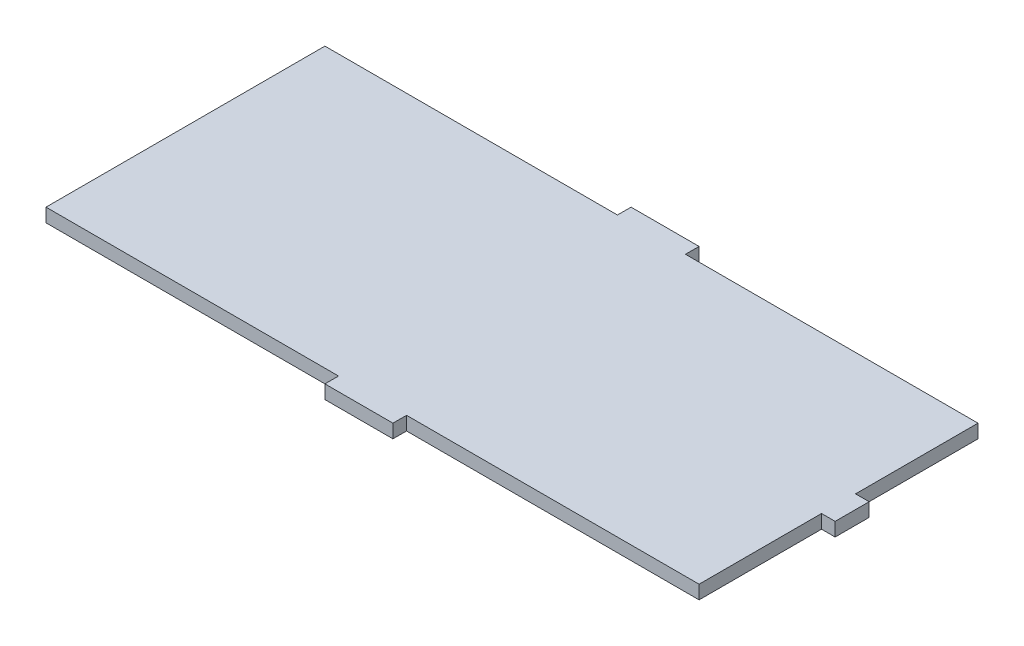
ISO-10303-21;
HEADER;
FILE_DESCRIPTION(('STEP AP214'),'2;1');
FILE_NAME('part.step','',(''),(''),'','','');
FILE_SCHEMA(('AUTOMOTIVE_DESIGN { 1 0 10303 214 1 1 1 1 }'));
ENDSEC;
DATA;
#1=APPLICATION_CONTEXT('core data for automotive mechanical design processes');
#2=APPLICATION_PROTOCOL_DEFINITION('international standard','automotive_design',2000,#1);
#3=PRODUCT_CONTEXT('',#1,'mechanical');
#4=PRODUCT('Part','Part','',(#3));
#5=PRODUCT_RELATED_PRODUCT_CATEGORY('part','',(#4));
#6=PRODUCT_DEFINITION_FORMATION('','',#4);
#7=PRODUCT_DEFINITION_CONTEXT('part definition',#1,'design');
#8=PRODUCT_DEFINITION('design','',#6,#7);
#9=PRODUCT_DEFINITION_SHAPE('','',#8);
#10=(LENGTH_UNIT() NAMED_UNIT(*) SI_UNIT(.MILLI.,.METRE.));
#11=(NAMED_UNIT(*) PLANE_ANGLE_UNIT() SI_UNIT($,.RADIAN.));
#12=(NAMED_UNIT(*) SI_UNIT($,.STERADIAN.) SOLID_ANGLE_UNIT());
#13=UNCERTAINTY_MEASURE_WITH_UNIT(LENGTH_MEASURE(1.E-05),#10,'distance_accuracy_value','');
#14=(GEOMETRIC_REPRESENTATION_CONTEXT(3) GLOBAL_UNCERTAINTY_ASSIGNED_CONTEXT((#13)) GLOBAL_UNIT_ASSIGNED_CONTEXT((#10,
#11,#12)) REPRESENTATION_CONTEXT('',''));
#15=CARTESIAN_POINT('',(0.,0.,0.));
#16=DIRECTION('',(0.,0.,1.));
#17=DIRECTION('',(1.,0.,0.));
#18=AXIS2_PLACEMENT_3D('',#15,#16,#17);
#19=CARTESIAN_POINT('',(0.,2.,-41.));
#20=DIRECTION('',(1.,0.,0.));
#21=DIRECTION('',(0.,0.,-1.));
#22=AXIS2_PLACEMENT_3D('',#19,#20,#21);
#23=PLANE('',#22);
#24=DIRECTION('',(0.,0.,1.));
#25=VECTOR('',#24,1.);
#26=CARTESIAN_POINT('',(0.,0.,-41.));
#27=LINE('',#26,#25);
#28=CARTESIAN_POINT('',(0.,0.,-41.));
#29=VERTEX_POINT('',#28);
#30=CARTESIAN_POINT('',(0.,0.,0.));
#31=VERTEX_POINT('',#30);
#32=EDGE_CURVE('E178',#29,#31,#27,.T.);
#33=ORIENTED_EDGE('',*,*,#32,.T.);
#34=DIRECTION('',(0.,-1.,0.));
#35=VECTOR('',#34,1.);
#36=CARTESIAN_POINT('',(0.,2.,0.));
#37=LINE('',#36,#35);
#38=CARTESIAN_POINT('',(0.,2.,0.));
#39=VERTEX_POINT('',#38);
#40=EDGE_CURVE('E11',#39,#31,#37,.T.);
#41=ORIENTED_EDGE('',*,*,#40,.F.);
#42=DIRECTION('',(0.,0.,1.));
#43=VECTOR('',#42,1.);
#44=CARTESIAN_POINT('',(0.,2.,-41.));
#45=LINE('',#44,#43);
#46=CARTESIAN_POINT('',(0.,2.,-41.));
#47=VERTEX_POINT('',#46);
#48=EDGE_CURVE('E208',#47,#39,#45,.T.);
#49=ORIENTED_EDGE('',*,*,#48,.F.);
#50=DIRECTION('',(0.,-1.,0.));
#51=VECTOR('',#50,1.);
#52=CARTESIAN_POINT('',(0.,2.,-41.));
#53=LINE('',#52,#51);
#54=EDGE_CURVE('E174',#47,#29,#53,.T.);
#55=ORIENTED_EDGE('',*,*,#54,.T.);
#56=EDGE_LOOP('',(#33,#41,#49,#55));
#57=FACE_BOUND('',#56,.T.);
#58=ADVANCED_FACE('F34',(#57),#23,.F.);
#59=CARTESIAN_POINT('',(0.,2.,0.));
#60=DIRECTION('',(0.,0.,-1.));
#61=DIRECTION('',(-1.,0.,0.));
#62=AXIS2_PLACEMENT_3D('',#59,#60,#61);
#63=PLANE('',#62);
#64=DIRECTION('',(1.,0.,0.));
#65=VECTOR('',#64,1.);
#66=CARTESIAN_POINT('',(0.,0.,0.));
#67=LINE('',#66,#65);
#68=CARTESIAN_POINT('',(43.,0.,0.));
#69=VERTEX_POINT('',#68);
#70=EDGE_CURVE('E181',#31,#69,#67,.T.);
#71=ORIENTED_EDGE('',*,*,#70,.T.);
#72=DIRECTION('',(0.,-1.,0.));
#73=VECTOR('',#72,1.);
#74=CARTESIAN_POINT('',(43.,2.,0.));
#75=LINE('',#74,#73);
#76=CARTESIAN_POINT('',(43.,2.,0.));
#77=VERTEX_POINT('',#76);
#78=EDGE_CURVE('E42',#77,#69,#75,.T.);
#79=ORIENTED_EDGE('',*,*,#78,.F.);
#80=DIRECTION('',(1.,0.,0.));
#81=VECTOR('',#80,1.);
#82=CARTESIAN_POINT('',(0.,2.,0.));
#83=LINE('',#82,#81);
#84=EDGE_CURVE('E117',#39,#77,#83,.T.);
#85=ORIENTED_EDGE('',*,*,#84,.F.);
#86=ORIENTED_EDGE('',*,*,#40,.T.);
#87=EDGE_LOOP('',(#71,#79,#85,#86));
#88=FACE_BOUND('',#87,.T.);
#89=ADVANCED_FACE('F306',(#88),#63,.F.);
#90=CARTESIAN_POINT('',(43.,2.,0.));
#91=DIRECTION('',(1.,0.,0.));
#92=DIRECTION('',(0.,0.,-1.));
#93=AXIS2_PLACEMENT_3D('',#90,#91,#92);
#94=PLANE('',#93);
#95=DIRECTION('',(0.,0.,1.));
#96=VECTOR('',#95,1.);
#97=CARTESIAN_POINT('',(43.,0.,0.));
#98=LINE('',#97,#96);
#99=CARTESIAN_POINT('',(43.,0.,2.));
#100=VERTEX_POINT('',#99);
#101=EDGE_CURVE('E183',#69,#100,#98,.T.);
#102=ORIENTED_EDGE('',*,*,#101,.T.);
#103=DIRECTION('',(0.,-1.,0.));
#104=VECTOR('',#103,1.);
#105=CARTESIAN_POINT('',(43.,2.,2.));
#106=LINE('',#105,#104);
#107=CARTESIAN_POINT('',(43.,2.,2.));
#108=VERTEX_POINT('',#107);
#109=EDGE_CURVE('E239',#108,#100,#106,.T.);
#110=ORIENTED_EDGE('',*,*,#109,.F.);
#111=DIRECTION('',(0.,0.,1.));
#112=VECTOR('',#111,1.);
#113=CARTESIAN_POINT('',(43.,2.,0.));
#114=LINE('',#113,#112);
#115=EDGE_CURVE('E247',#77,#108,#114,.T.);
#116=ORIENTED_EDGE('',*,*,#115,.F.);
#117=ORIENTED_EDGE('',*,*,#78,.T.);
#118=EDGE_LOOP('',(#102,#110,#116,#117));
#119=FACE_BOUND('',#118,.T.);
#120=ADVANCED_FACE('F245',(#119),#94,.F.);
#121=CARTESIAN_POINT('',(43.,2.,2.));
#122=DIRECTION('',(0.,0.,-1.));
#123=DIRECTION('',(-1.,0.,0.));
#124=AXIS2_PLACEMENT_3D('',#121,#122,#123);
#125=PLANE('',#124);
#126=DIRECTION('',(1.,0.,0.));
#127=VECTOR('',#126,1.);
#128=CARTESIAN_POINT('',(43.,0.,2.));
#129=LINE('',#128,#127);
#130=CARTESIAN_POINT('',(53.,0.,2.));
#131=VERTEX_POINT('',#130);
#132=EDGE_CURVE('E185',#100,#131,#129,.T.);
#133=ORIENTED_EDGE('',*,*,#132,.T.);
#134=DIRECTION('',(0.,-1.,0.));
#135=VECTOR('',#134,1.);
#136=CARTESIAN_POINT('',(53.,2.,2.));
#137=LINE('',#136,#135);
#138=CARTESIAN_POINT('',(53.,2.,2.));
#139=VERTEX_POINT('',#138);
#140=EDGE_CURVE('E236',#139,#131,#137,.T.);
#141=ORIENTED_EDGE('',*,*,#140,.F.);
#142=DIRECTION('',(1.,0.,0.));
#143=VECTOR('',#142,1.);
#144=CARTESIAN_POINT('',(43.,2.,2.));
#145=LINE('',#144,#143);
#146=EDGE_CURVE('E265',#108,#139,#145,.T.);
#147=ORIENTED_EDGE('',*,*,#146,.F.);
#148=ORIENTED_EDGE('',*,*,#109,.T.);
#149=EDGE_LOOP('',(#133,#141,#147,#148));
#150=FACE_BOUND('',#149,.T.);
#151=ADVANCED_FACE('F256',(#150),#125,.F.);
#152=CARTESIAN_POINT('',(53.,2.,2.));
#153=DIRECTION('',(-1.,0.,0.));
#154=DIRECTION('',(0.,0.,1.));
#155=AXIS2_PLACEMENT_3D('',#152,#153,#154);
#156=PLANE('',#155);
#157=DIRECTION('',(0.,0.,-1.));
#158=VECTOR('',#157,1.);
#159=CARTESIAN_POINT('',(53.,0.,2.));
#160=LINE('',#159,#158);
#161=CARTESIAN_POINT('',(53.,0.,0.));
#162=VERTEX_POINT('',#161);
#163=EDGE_CURVE('E187',#131,#162,#160,.T.);
#164=ORIENTED_EDGE('',*,*,#163,.T.);
#165=DIRECTION('',(0.,-1.,0.));
#166=VECTOR('',#165,1.);
#167=CARTESIAN_POINT('',(53.,2.,0.));
#168=LINE('',#167,#166);
#169=CARTESIAN_POINT('',(53.,2.,0.));
#170=VERTEX_POINT('',#169);
#171=EDGE_CURVE('E233',#170,#162,#168,.T.);
#172=ORIENTED_EDGE('',*,*,#171,.F.);
#173=DIRECTION('',(0.,0.,-1.));
#174=VECTOR('',#173,1.);
#175=CARTESIAN_POINT('',(53.,2.,2.));
#176=LINE('',#175,#174);
#177=EDGE_CURVE('E262',#139,#170,#176,.T.);
#178=ORIENTED_EDGE('',*,*,#177,.F.);
#179=ORIENTED_EDGE('',*,*,#140,.T.);
#180=EDGE_LOOP('',(#164,#172,#178,#179));
#181=FACE_BOUND('',#180,.T.);
#182=ADVANCED_FACE('F260',(#181),#156,.F.);
#183=CARTESIAN_POINT('',(53.,2.,0.));
#184=DIRECTION('',(0.,0.,-1.));
#185=DIRECTION('',(-1.,0.,0.));
#186=AXIS2_PLACEMENT_3D('',#183,#184,#185);
#187=PLANE('',#186);
#188=DIRECTION('',(1.,0.,0.));
#189=VECTOR('',#188,1.);
#190=CARTESIAN_POINT('',(53.,0.,0.));
#191=LINE('',#190,#189);
#192=CARTESIAN_POINT('',(96.,0.,0.));
#193=VERTEX_POINT('',#192);
#194=EDGE_CURVE('E189',#162,#193,#191,.T.);
#195=ORIENTED_EDGE('',*,*,#194,.T.);
#196=DIRECTION('',(0.,-1.,0.));
#197=VECTOR('',#196,1.);
#198=CARTESIAN_POINT('',(96.,2.,0.));
#199=LINE('',#198,#197);
#200=CARTESIAN_POINT('',(96.,2.,0.));
#201=VERTEX_POINT('',#200);
#202=EDGE_CURVE('E230',#201,#193,#199,.T.);
#203=ORIENTED_EDGE('',*,*,#202,.F.);
#204=DIRECTION('',(1.,0.,0.));
#205=VECTOR('',#204,1.);
#206=CARTESIAN_POINT('',(53.,2.,0.));
#207=LINE('',#206,#205);
#208=EDGE_CURVE('E264',#170,#201,#207,.T.);
#209=ORIENTED_EDGE('',*,*,#208,.F.);
#210=ORIENTED_EDGE('',*,*,#171,.T.);
#211=EDGE_LOOP('',(#195,#203,#209,#210));
#212=FACE_BOUND('',#211,.T.);
#213=ADVANCED_FACE('F319',(#212),#187,.F.);
#214=CARTESIAN_POINT('',(96.,2.,0.));
#215=DIRECTION('',(-1.,0.,0.));
#216=DIRECTION('',(0.,0.,1.));
#217=AXIS2_PLACEMENT_3D('',#214,#215,#216);
#218=PLANE('',#217);
#219=DIRECTION('',(0.,0.,-1.));
#220=VECTOR('',#219,1.);
#221=CARTESIAN_POINT('',(96.,0.,0.));
#222=LINE('',#221,#220);
#223=CARTESIAN_POINT('',(96.,0.,-18.));
#224=VERTEX_POINT('',#223);
#225=EDGE_CURVE('E191',#193,#224,#222,.T.);
#226=ORIENTED_EDGE('',*,*,#225,.T.);
#227=DIRECTION('',(0.,-1.,0.));
#228=VECTOR('',#227,1.);
#229=CARTESIAN_POINT('',(96.,2.,-18.));
#230=LINE('',#229,#228);
#231=CARTESIAN_POINT('',(96.,2.,-18.));
#232=VERTEX_POINT('',#231);
#233=EDGE_CURVE('E227',#232,#224,#230,.T.);
#234=ORIENTED_EDGE('',*,*,#233,.F.);
#235=DIRECTION('',(0.,0.,-1.));
#236=VECTOR('',#235,1.);
#237=CARTESIAN_POINT('',(96.,2.,0.));
#238=LINE('',#237,#236);
#239=EDGE_CURVE('E267',#201,#232,#238,.T.);
#240=ORIENTED_EDGE('',*,*,#239,.F.);
#241=ORIENTED_EDGE('',*,*,#202,.T.);
#242=EDGE_LOOP('',(#226,#234,#240,#241));
#243=FACE_BOUND('',#242,.T.);
#244=ADVANCED_FACE('F322',(#243),#218,.F.);
#245=CARTESIAN_POINT('',(96.,2.,-18.));
#246=DIRECTION('',(0.,0.,-1.));
#247=DIRECTION('',(-1.,0.,0.));
#248=AXIS2_PLACEMENT_3D('',#245,#246,#247);
#249=PLANE('',#248);
#250=DIRECTION('',(1.,0.,0.));
#251=VECTOR('',#250,1.);
#252=CARTESIAN_POINT('',(96.,0.,-18.));
#253=LINE('',#252,#251);
#254=CARTESIAN_POINT('',(98.,0.,-18.));
#255=VERTEX_POINT('',#254);
#256=EDGE_CURVE('E193',#224,#255,#253,.T.);
#257=ORIENTED_EDGE('',*,*,#256,.T.);
#258=DIRECTION('',(0.,-1.,0.));
#259=VECTOR('',#258,1.);
#260=CARTESIAN_POINT('',(98.,2.,-18.));
#261=LINE('',#260,#259);
#262=CARTESIAN_POINT('',(98.,2.,-18.));
#263=VERTEX_POINT('',#262);
#264=EDGE_CURVE('E224',#263,#255,#261,.T.);
#265=ORIENTED_EDGE('',*,*,#264,.F.);
#266=DIRECTION('',(1.,0.,0.));
#267=VECTOR('',#266,1.);
#268=CARTESIAN_POINT('',(96.,2.,-18.));
#269=LINE('',#268,#267);
#270=EDGE_CURVE('E273',#232,#263,#269,.T.);
#271=ORIENTED_EDGE('',*,*,#270,.F.);
#272=ORIENTED_EDGE('',*,*,#233,.T.);
#273=EDGE_LOOP('',(#257,#265,#271,#272));
#274=FACE_BOUND('',#273,.T.);
#275=ADVANCED_FACE('F326',(#274),#249,.F.);
#276=CARTESIAN_POINT('',(98.,2.,-18.));
#277=DIRECTION('',(-1.,0.,0.));
#278=DIRECTION('',(0.,0.,1.));
#279=AXIS2_PLACEMENT_3D('',#276,#277,#278);
#280=PLANE('',#279);
#281=DIRECTION('',(0.,0.,-1.));
#282=VECTOR('',#281,1.);
#283=CARTESIAN_POINT('',(98.,0.,-18.));
#284=LINE('',#283,#282);
#285=CARTESIAN_POINT('',(98.,0.,-23.));
#286=VERTEX_POINT('',#285);
#287=EDGE_CURVE('E195',#255,#286,#284,.T.);
#288=ORIENTED_EDGE('',*,*,#287,.T.);
#289=DIRECTION('',(0.,-1.,0.));
#290=VECTOR('',#289,1.);
#291=CARTESIAN_POINT('',(98.,2.,-23.));
#292=LINE('',#291,#290);
#293=CARTESIAN_POINT('',(98.,2.,-23.));
#294=VERTEX_POINT('',#293);
#295=EDGE_CURVE('E221',#294,#286,#292,.T.);
#296=ORIENTED_EDGE('',*,*,#295,.F.);
#297=DIRECTION('',(0.,0.,-1.));
#298=VECTOR('',#297,1.);
#299=CARTESIAN_POINT('',(98.,2.,-18.));
#300=LINE('',#299,#298);
#301=EDGE_CURVE('E275',#263,#294,#300,.T.);
#302=ORIENTED_EDGE('',*,*,#301,.F.);
#303=ORIENTED_EDGE('',*,*,#264,.T.);
#304=EDGE_LOOP('',(#288,#296,#302,#303));
#305=FACE_BOUND('',#304,.T.);
#306=ADVANCED_FACE('F330',(#305),#280,.F.);
#307=CARTESIAN_POINT('',(98.,2.,-23.));
#308=DIRECTION('',(0.,0.,1.));
#309=DIRECTION('',(1.,0.,0.));
#310=AXIS2_PLACEMENT_3D('',#307,#308,#309);
#311=PLANE('',#310);
#312=DIRECTION('',(-1.,0.,0.));
#313=VECTOR('',#312,1.);
#314=CARTESIAN_POINT('',(98.,0.,-23.));
#315=LINE('',#314,#313);
#316=CARTESIAN_POINT('',(96.,0.,-23.));
#317=VERTEX_POINT('',#316);
#318=EDGE_CURVE('E197',#286,#317,#315,.T.);
#319=ORIENTED_EDGE('',*,*,#318,.T.);
#320=DIRECTION('',(0.,-1.,0.));
#321=VECTOR('',#320,1.);
#322=CARTESIAN_POINT('',(96.,2.,-23.));
#323=LINE('',#322,#321);
#324=CARTESIAN_POINT('',(96.,2.,-23.));
#325=VERTEX_POINT('',#324);
#326=EDGE_CURVE('E218',#325,#317,#323,.T.);
#327=ORIENTED_EDGE('',*,*,#326,.F.);
#328=DIRECTION('',(-1.,0.,0.));
#329=VECTOR('',#328,1.);
#330=CARTESIAN_POINT('',(98.,2.,-23.));
#331=LINE('',#330,#329);
#332=EDGE_CURVE('E277',#294,#325,#331,.T.);
#333=ORIENTED_EDGE('',*,*,#332,.F.);
#334=ORIENTED_EDGE('',*,*,#295,.T.);
#335=EDGE_LOOP('',(#319,#327,#333,#334));
#336=FACE_BOUND('',#335,.T.);
#337=ADVANCED_FACE('F334',(#336),#311,.F.);
#338=CARTESIAN_POINT('',(96.,2.,-23.));
#339=DIRECTION('',(-1.,0.,0.));
#340=DIRECTION('',(0.,0.,1.));
#341=AXIS2_PLACEMENT_3D('',#338,#339,#340);
#342=PLANE('',#341);
#343=DIRECTION('',(0.,0.,-1.));
#344=VECTOR('',#343,1.);
#345=CARTESIAN_POINT('',(96.,0.,-23.));
#346=LINE('',#345,#344);
#347=CARTESIAN_POINT('',(96.,0.,-41.));
#348=VERTEX_POINT('',#347);
#349=EDGE_CURVE('E199',#317,#348,#346,.T.);
#350=ORIENTED_EDGE('',*,*,#349,.T.);
#351=DIRECTION('',(0.,-1.,0.));
#352=VECTOR('',#351,1.);
#353=CARTESIAN_POINT('',(96.,2.,-41.));
#354=LINE('',#353,#352);
#355=CARTESIAN_POINT('',(96.,2.,-41.));
#356=VERTEX_POINT('',#355);
#357=EDGE_CURVE('E215',#356,#348,#354,.T.);
#358=ORIENTED_EDGE('',*,*,#357,.F.);
#359=DIRECTION('',(0.,0.,-1.));
#360=VECTOR('',#359,1.);
#361=CARTESIAN_POINT('',(96.,2.,-23.));
#362=LINE('',#361,#360);
#363=EDGE_CURVE('E279',#325,#356,#362,.T.);
#364=ORIENTED_EDGE('',*,*,#363,.F.);
#365=ORIENTED_EDGE('',*,*,#326,.T.);
#366=EDGE_LOOP('',(#350,#358,#364,#365));
#367=FACE_BOUND('',#366,.T.);
#368=ADVANCED_FACE('F338',(#367),#342,.F.);
#369=CARTESIAN_POINT('',(96.,2.,-41.));
#370=DIRECTION('',(0.,0.,1.));
#371=DIRECTION('',(1.,0.,0.));
#372=AXIS2_PLACEMENT_3D('',#369,#370,#371);
#373=PLANE('',#372);
#374=DIRECTION('',(-1.,0.,0.));
#375=VECTOR('',#374,1.);
#376=CARTESIAN_POINT('',(96.,0.,-41.));
#377=LINE('',#376,#375);
#378=CARTESIAN_POINT('',(53.,0.,-41.));
#379=VERTEX_POINT('',#378);
#380=EDGE_CURVE('E201',#348,#379,#377,.T.);
#381=ORIENTED_EDGE('',*,*,#380,.T.);
#382=DIRECTION('',(0.,-1.,0.));
#383=VECTOR('',#382,1.);
#384=CARTESIAN_POINT('',(53.,2.,-41.));
#385=LINE('',#384,#383);
#386=CARTESIAN_POINT('',(53.,2.,-41.));
#387=VERTEX_POINT('',#386);
#388=EDGE_CURVE('E212',#387,#379,#385,.T.);
#389=ORIENTED_EDGE('',*,*,#388,.F.);
#390=DIRECTION('',(-1.,0.,0.));
#391=VECTOR('',#390,1.);
#392=CARTESIAN_POINT('',(96.,2.,-41.));
#393=LINE('',#392,#391);
#394=EDGE_CURVE('E281',#356,#387,#393,.T.);
#395=ORIENTED_EDGE('',*,*,#394,.F.);
#396=ORIENTED_EDGE('',*,*,#357,.T.);
#397=EDGE_LOOP('',(#381,#389,#395,#396));
#398=FACE_BOUND('',#397,.T.);
#399=ADVANCED_FACE('F287',(#398),#373,.F.);
#400=CARTESIAN_POINT('',(53.,2.,-41.));
#401=DIRECTION('',(-1.,0.,0.));
#402=DIRECTION('',(0.,0.,1.));
#403=AXIS2_PLACEMENT_3D('',#400,#401,#402);
#404=PLANE('',#403);
#405=DIRECTION('',(0.,0.,-1.));
#406=VECTOR('',#405,1.);
#407=CARTESIAN_POINT('',(53.,0.,-41.));
#408=LINE('',#407,#406);
#409=CARTESIAN_POINT('',(53.,0.,-43.));
#410=VERTEX_POINT('',#409);
#411=EDGE_CURVE('E203',#379,#410,#408,.T.);
#412=ORIENTED_EDGE('',*,*,#411,.T.);
#413=DIRECTION('',(0.,-1.,0.));
#414=VECTOR('',#413,1.);
#415=CARTESIAN_POINT('',(53.,2.,-43.));
#416=LINE('',#415,#414);
#417=CARTESIAN_POINT('',(53.,2.,-43.));
#418=VERTEX_POINT('',#417);
#419=EDGE_CURVE('E169',#418,#410,#416,.T.);
#420=ORIENTED_EDGE('',*,*,#419,.F.);
#421=DIRECTION('',(0.,0.,-1.));
#422=VECTOR('',#421,1.);
#423=CARTESIAN_POINT('',(53.,2.,-41.));
#424=LINE('',#423,#422);
#425=EDGE_CURVE('E160',#387,#418,#424,.T.);
#426=ORIENTED_EDGE('',*,*,#425,.F.);
#427=ORIENTED_EDGE('',*,*,#388,.T.);
#428=EDGE_LOOP('',(#412,#420,#426,#427));
#429=FACE_BOUND('',#428,.T.);
#430=ADVANCED_FACE('F291',(#429),#404,.F.);
#431=CARTESIAN_POINT('',(53.,2.,-43.));
#432=DIRECTION('',(0.,0.,1.));
#433=DIRECTION('',(1.,0.,0.));
#434=AXIS2_PLACEMENT_3D('',#431,#432,#433);
#435=PLANE('',#434);
#436=DIRECTION('',(-1.,0.,0.));
#437=VECTOR('',#436,1.);
#438=CARTESIAN_POINT('',(53.,0.,-43.));
#439=LINE('',#438,#437);
#440=CARTESIAN_POINT('',(43.,0.,-43.));
#441=VERTEX_POINT('',#440);
#442=EDGE_CURVE('E168',#410,#441,#439,.T.);
#443=ORIENTED_EDGE('',*,*,#442,.T.);
#444=DIRECTION('',(0.,-1.,0.));
#445=VECTOR('',#444,1.);
#446=CARTESIAN_POINT('',(43.,2.,-43.));
#447=LINE('',#446,#445);
#448=CARTESIAN_POINT('',(43.,2.,-43.));
#449=VERTEX_POINT('',#448);
#450=EDGE_CURVE('E165',#449,#441,#447,.T.);
#451=ORIENTED_EDGE('',*,*,#450,.F.);
#452=DIRECTION('',(-1.,0.,0.));
#453=VECTOR('',#452,1.);
#454=CARTESIAN_POINT('',(53.,2.,-43.));
#455=LINE('',#454,#453);
#456=EDGE_CURVE('E154',#418,#449,#455,.T.);
#457=ORIENTED_EDGE('',*,*,#456,.F.);
#458=ORIENTED_EDGE('',*,*,#419,.T.);
#459=EDGE_LOOP('',(#443,#451,#457,#458));
#460=FACE_BOUND('',#459,.T.);
#461=ADVANCED_FACE('F166',(#460),#435,.F.);
#462=CARTESIAN_POINT('',(43.,2.,-43.));
#463=DIRECTION('',(1.,0.,0.));
#464=DIRECTION('',(0.,0.,-1.));
#465=AXIS2_PLACEMENT_3D('',#462,#463,#464);
#466=PLANE('',#465);
#467=DIRECTION('',(0.,0.,1.));
#468=VECTOR('',#467,1.);
#469=CARTESIAN_POINT('',(43.,0.,-43.));
#470=LINE('',#469,#468);
#471=CARTESIAN_POINT('',(43.,0.,-41.));
#472=VERTEX_POINT('',#471);
#473=EDGE_CURVE('E103',#441,#472,#470,.T.);
#474=ORIENTED_EDGE('',*,*,#473,.T.);
#475=DIRECTION('',(0.,-1.,0.));
#476=VECTOR('',#475,1.);
#477=CARTESIAN_POINT('',(43.,2.,-41.));
#478=LINE('',#477,#476);
#479=CARTESIAN_POINT('',(43.,2.,-41.));
#480=VERTEX_POINT('',#479);
#481=EDGE_CURVE('E170',#480,#472,#478,.T.);
#482=ORIENTED_EDGE('',*,*,#481,.F.);
#483=DIRECTION('',(0.,0.,1.));
#484=VECTOR('',#483,1.);
#485=CARTESIAN_POINT('',(43.,2.,-43.));
#486=LINE('',#485,#484);
#487=EDGE_CURVE('E158',#449,#480,#486,.T.);
#488=ORIENTED_EDGE('',*,*,#487,.F.);
#489=ORIENTED_EDGE('',*,*,#450,.T.);
#490=EDGE_LOOP('',(#474,#482,#488,#489));
#491=FACE_BOUND('',#490,.T.);
#492=ADVANCED_FACE('F172',(#491),#466,.F.);
#493=CARTESIAN_POINT('',(43.,2.,-41.));
#494=DIRECTION('',(0.,0.,1.));
#495=DIRECTION('',(1.,0.,0.));
#496=AXIS2_PLACEMENT_3D('',#493,#494,#495);
#497=PLANE('',#496);
#498=DIRECTION('',(-1.,0.,0.));
#499=VECTOR('',#498,1.);
#500=CARTESIAN_POINT('',(43.,0.,-41.));
#501=LINE('',#500,#499);
#502=EDGE_CURVE('E109',#472,#29,#501,.T.);
#503=ORIENTED_EDGE('',*,*,#502,.T.);
#504=ORIENTED_EDGE('',*,*,#54,.F.);
#505=DIRECTION('',(-1.,0.,0.));
#506=VECTOR('',#505,1.);
#507=CARTESIAN_POINT('',(43.,2.,-41.));
#508=LINE('',#507,#506);
#509=EDGE_CURVE('E50',#480,#47,#508,.T.);
#510=ORIENTED_EDGE('',*,*,#509,.F.);
#511=ORIENTED_EDGE('',*,*,#481,.T.);
#512=EDGE_LOOP('',(#503,#504,#510,#511));
#513=FACE_BOUND('',#512,.T.);
#514=ADVANCED_FACE('F295',(#513),#497,.F.);
#515=CARTESIAN_POINT('',(0.,2.,0.));
#516=DIRECTION('',(0.,1.,0.));
#517=DIRECTION('',(0.,0.,1.));
#518=AXIS2_PLACEMENT_3D('',#515,#516,#517);
#519=PLANE('',#518);
#520=ORIENTED_EDGE('',*,*,#48,.T.);
#521=ORIENTED_EDGE('',*,*,#84,.T.);
#522=ORIENTED_EDGE('',*,*,#115,.T.);
#523=ORIENTED_EDGE('',*,*,#146,.T.);
#524=ORIENTED_EDGE('',*,*,#177,.T.);
#525=ORIENTED_EDGE('',*,*,#208,.T.);
#526=ORIENTED_EDGE('',*,*,#239,.T.);
#527=ORIENTED_EDGE('',*,*,#270,.T.);
#528=ORIENTED_EDGE('',*,*,#301,.T.);
#529=ORIENTED_EDGE('',*,*,#332,.T.);
#530=ORIENTED_EDGE('',*,*,#363,.T.);
#531=ORIENTED_EDGE('',*,*,#394,.T.);
#532=ORIENTED_EDGE('',*,*,#425,.T.);
#533=ORIENTED_EDGE('',*,*,#456,.T.);
#534=ORIENTED_EDGE('',*,*,#487,.T.);
#535=ORIENTED_EDGE('',*,*,#509,.T.);
#536=EDGE_LOOP('',(#520,#521,#522,#523,#524,#525,#526,#527,#528,#529,#530,#531,#532,#533,#534,#535));
#537=FACE_BOUND('',#536,.T.);
#538=ADVANCED_FACE('F156',(#537),#519,.T.);
#539=CARTESIAN_POINT('',(0.,0.,0.));
#540=DIRECTION('',(0.,1.,0.));
#541=DIRECTION('',(0.,0.,1.));
#542=AXIS2_PLACEMENT_3D('',#539,#540,#541);
#543=PLANE('',#542);
#544=ORIENTED_EDGE('',*,*,#32,.F.);
#545=ORIENTED_EDGE('',*,*,#502,.F.);
#546=ORIENTED_EDGE('',*,*,#473,.F.);
#547=ORIENTED_EDGE('',*,*,#442,.F.);
#548=ORIENTED_EDGE('',*,*,#411,.F.);
#549=ORIENTED_EDGE('',*,*,#380,.F.);
#550=ORIENTED_EDGE('',*,*,#349,.F.);
#551=ORIENTED_EDGE('',*,*,#318,.F.);
#552=ORIENTED_EDGE('',*,*,#287,.F.);
#553=ORIENTED_EDGE('',*,*,#256,.F.);
#554=ORIENTED_EDGE('',*,*,#225,.F.);
#555=ORIENTED_EDGE('',*,*,#194,.F.);
#556=ORIENTED_EDGE('',*,*,#163,.F.);
#557=ORIENTED_EDGE('',*,*,#132,.F.);
#558=ORIENTED_EDGE('',*,*,#101,.F.);
#559=ORIENTED_EDGE('',*,*,#70,.F.);
#560=EDGE_LOOP('',(#544,#545,#546,#547,#548,#549,#550,#551,#552,#553,#554,#555,#556,#557,#558,#559));
#561=FACE_BOUND('',#560,.T.);
#562=ADVANCED_FACE('F251',(#561),#543,.F.);
#563=CLOSED_SHELL('',(#58,#89,#120,#151,#182,#213,#244,#275,#306,#337,#368,#399,#430,#461,#492,
#514,#538,#562));
#564=MANIFOLD_SOLID_BREP('B2',#563);
#565=ADVANCED_BREP_SHAPE_REPRESENTATION('',(#18,#564),#14);
#566=SHAPE_DEFINITION_REPRESENTATION(#9,#565);
ENDSEC;
END-ISO-10303-21;
